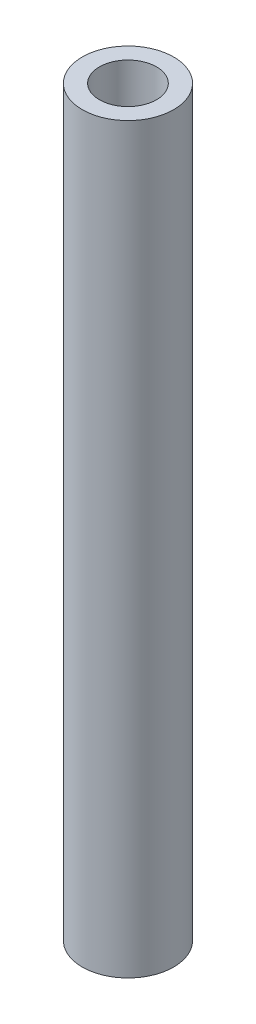
ISO-10303-21;
HEADER;
FILE_DESCRIPTION(('STEP AP214'),'2;1');
FILE_NAME('part.step','',(''),(''),'','','');
FILE_SCHEMA(('AUTOMOTIVE_DESIGN { 1 0 10303 214 1 1 1 1 }'));
ENDSEC;
DATA;
#1=APPLICATION_CONTEXT('core data for automotive mechanical design processes');
#2=APPLICATION_PROTOCOL_DEFINITION('international standard','automotive_design',2000,#1);
#3=PRODUCT_CONTEXT('',#1,'mechanical');
#4=PRODUCT('Part','Part','',(#3));
#5=PRODUCT_RELATED_PRODUCT_CATEGORY('part','',(#4));
#6=PRODUCT_DEFINITION_FORMATION('','',#4);
#7=PRODUCT_DEFINITION_CONTEXT('part definition',#1,'design');
#8=PRODUCT_DEFINITION('design','',#6,#7);
#9=PRODUCT_DEFINITION_SHAPE('','',#8);
#10=(LENGTH_UNIT() NAMED_UNIT(*) SI_UNIT(.MILLI.,.METRE.));
#11=(NAMED_UNIT(*) PLANE_ANGLE_UNIT() SI_UNIT($,.RADIAN.));
#12=(NAMED_UNIT(*) SI_UNIT($,.STERADIAN.) SOLID_ANGLE_UNIT());
#13=UNCERTAINTY_MEASURE_WITH_UNIT(LENGTH_MEASURE(1.E-05),#10,'distance_accuracy_value','');
#14=(GEOMETRIC_REPRESENTATION_CONTEXT(3) GLOBAL_UNCERTAINTY_ASSIGNED_CONTEXT((#13)) GLOBAL_UNIT_ASSIGNED_CONTEXT((#10,
#11,#12)) REPRESENTATION_CONTEXT('',''));
#15=CARTESIAN_POINT('',(0.,0.,0.));
#16=DIRECTION('',(0.,0.,1.));
#17=DIRECTION('',(1.,0.,0.));
#18=AXIS2_PLACEMENT_3D('',#15,#16,#17);
#19=CARTESIAN_POINT('',(0.,65.,0.));
#20=DIRECTION('',(0.,1.,0.));
#21=DIRECTION('',(0.,0.,1.));
#22=AXIS2_PLACEMENT_3D('',#19,#20,#21);
#23=PLANE('',#22);
#24=CARTESIAN_POINT('',(0.,65.,0.));
#25=DIRECTION('',(0.,1.,0.));
#26=DIRECTION('',(0.,0.,1.));
#27=AXIS2_PLACEMENT_3D('',#24,#25,#26);
#28=CIRCLE('',#27,4.);
#29=CARTESIAN_POINT('',(0.,65.,4.));
#30=VERTEX_POINT('',#29);
#31=EDGE_CURVE('E10',#30,#30,#28,.T.);
#32=ORIENTED_EDGE('',*,*,#31,.T.);
#33=EDGE_LOOP('',(#32));
#34=FACE_BOUND('',#33,.T.);
#35=CARTESIAN_POINT('',(0.,65.,0.));
#36=DIRECTION('',(0.,1.,0.));
#37=DIRECTION('',(0.,0.,1.));
#38=AXIS2_PLACEMENT_3D('',#35,#36,#37);
#39=CIRCLE('',#38,2.5);
#40=CARTESIAN_POINT('',(0.,65.,2.5));
#41=VERTEX_POINT('',#40);
#42=EDGE_CURVE('E42',#41,#41,#39,.T.);
#43=ORIENTED_EDGE('',*,*,#42,.F.);
#44=EDGE_LOOP('',(#43));
#45=FACE_BOUND('',#44,.T.);
#46=ADVANCED_FACE('F31',(#34,#45),#23,.T.);
#47=CARTESIAN_POINT('',(0.,0.,0.));
#48=DIRECTION('',(0.,1.,0.));
#49=DIRECTION('',(0.,0.,1.));
#50=AXIS2_PLACEMENT_3D('',#47,#48,#49);
#51=PLANE('',#50);
#52=CARTESIAN_POINT('',(0.,0.,0.));
#53=DIRECTION('',(0.,1.,0.));
#54=DIRECTION('',(0.,0.,1.));
#55=AXIS2_PLACEMENT_3D('',#52,#53,#54);
#56=CIRCLE('',#55,4.);
#57=CARTESIAN_POINT('',(0.,0.,4.));
#58=VERTEX_POINT('',#57);
#59=EDGE_CURVE('E35',#58,#58,#56,.T.);
#60=ORIENTED_EDGE('',*,*,#59,.F.);
#61=EDGE_LOOP('',(#60));
#62=FACE_BOUND('',#61,.T.);
#63=CARTESIAN_POINT('',(0.,0.,0.));
#64=DIRECTION('',(0.,1.,0.));
#65=DIRECTION('',(0.,0.,1.));
#66=AXIS2_PLACEMENT_3D('',#63,#64,#65);
#67=CIRCLE('',#66,2.5);
#68=CARTESIAN_POINT('',(0.,0.,2.5));
#69=VERTEX_POINT('',#68);
#70=EDGE_CURVE('E44',#69,#69,#67,.T.);
#71=ORIENTED_EDGE('',*,*,#70,.T.);
#72=EDGE_LOOP('',(#71));
#73=FACE_BOUND('',#72,.T.);
#74=ADVANCED_FACE('F54',(#62,#73),#51,.F.);
#75=CARTESIAN_POINT('',(0.,65.,0.));
#76=DIRECTION('',(0.,-1.,0.));
#77=DIRECTION('',(0.,0.,-1.));
#78=AXIS2_PLACEMENT_3D('',#75,#76,#77);
#79=CYLINDRICAL_SURFACE('',#78,4.);
#80=ORIENTED_EDGE('',*,*,#31,.F.);
#81=EDGE_LOOP('',(#80));
#82=FACE_BOUND('',#81,.T.);
#83=ORIENTED_EDGE('',*,*,#59,.T.);
#84=EDGE_LOOP('',(#83));
#85=FACE_BOUND('',#84,.T.);
#86=ADVANCED_FACE('F33',(#82,#85),#79,.T.);
#87=CARTESIAN_POINT('',(0.,65.,0.));
#88=DIRECTION('',(0.,-1.,0.));
#89=DIRECTION('',(0.,0.,-1.));
#90=AXIS2_PLACEMENT_3D('',#87,#88,#89);
#91=CYLINDRICAL_SURFACE('',#90,2.5);
#92=ORIENTED_EDGE('',*,*,#42,.T.);
#93=EDGE_LOOP('',(#92));
#94=FACE_BOUND('',#93,.T.);
#95=ORIENTED_EDGE('',*,*,#70,.F.);
#96=EDGE_LOOP('',(#95));
#97=FACE_BOUND('',#96,.T.);
#98=ADVANCED_FACE('F50',(#94,#97),#91,.F.);
#99=CLOSED_SHELL('',(#46,#74,#86,#98));
#100=MANIFOLD_SOLID_BREP('B2',#99);
#101=ADVANCED_BREP_SHAPE_REPRESENTATION('',(#18,#100),#14);
#102=SHAPE_DEFINITION_REPRESENTATION(#9,#101);
ENDSEC;
END-ISO-10303-21;
